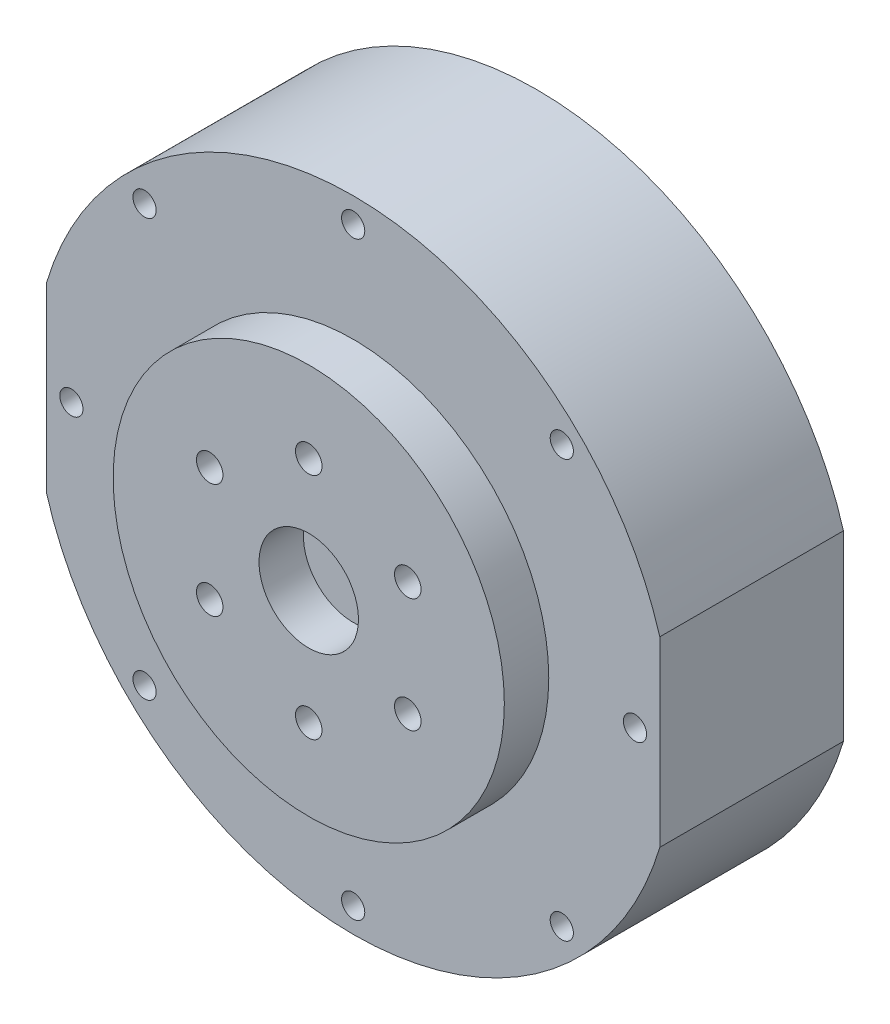
ISO-10303-21;
HEADER;
FILE_DESCRIPTION(('STEP AP214'),'2;1');
FILE_NAME('part.step','',(''),(''),'','','');
FILE_SCHEMA(('AUTOMOTIVE_DESIGN { 1 0 10303 214 1 1 1 1 }'));
ENDSEC;
DATA;
#1=APPLICATION_CONTEXT('core data for automotive mechanical design processes');
#2=APPLICATION_PROTOCOL_DEFINITION('international standard','automotive_design',2000,#1);
#3=PRODUCT_CONTEXT('',#1,'mechanical');
#4=PRODUCT('Part','Part','',(#3));
#5=PRODUCT_RELATED_PRODUCT_CATEGORY('part','',(#4));
#6=PRODUCT_DEFINITION_FORMATION('','',#4);
#7=PRODUCT_DEFINITION_CONTEXT('part definition',#1,'design');
#8=PRODUCT_DEFINITION('design','',#6,#7);
#9=PRODUCT_DEFINITION_SHAPE('','',#8);
#10=(LENGTH_UNIT() NAMED_UNIT(*) SI_UNIT(.MILLI.,.METRE.));
#11=(NAMED_UNIT(*) PLANE_ANGLE_UNIT() SI_UNIT($,.RADIAN.));
#12=(NAMED_UNIT(*) SI_UNIT($,.STERADIAN.) SOLID_ANGLE_UNIT());
#13=UNCERTAINTY_MEASURE_WITH_UNIT(LENGTH_MEASURE(1.E-05),#10,'distance_accuracy_value','');
#14=(GEOMETRIC_REPRESENTATION_CONTEXT(3) GLOBAL_UNCERTAINTY_ASSIGNED_CONTEXT((#13)) GLOBAL_UNIT_ASSIGNED_CONTEXT((#10,
#11,#12)) REPRESENTATION_CONTEXT('',''));
#15=CARTESIAN_POINT('',(0.,0.,0.));
#16=DIRECTION('',(0.,0.,1.));
#17=DIRECTION('',(1.,0.,0.));
#18=AXIS2_PLACEMENT_3D('',#15,#16,#17);
#19=CARTESIAN_POINT('',(0.,0.,27.7));
#20=DIRECTION('',(0.,0.,-1.));
#21=DIRECTION('',(-1.,0.,0.));
#22=AXIS2_PLACEMENT_3D('',#19,#20,#21);
#23=CYLINDRICAL_SURFACE('',#22,48.25);
#24=CARTESIAN_POINT('',(0.,0.,27.7));
#25=DIRECTION('',(0.,0.,1.));
#26=DIRECTION('',(1.,0.,0.));
#27=AXIS2_PLACEMENT_3D('',#24,#25,#26);
#28=CIRCLE('',#27,48.25);
#29=CARTESIAN_POINT('',(-46.25,-13.7477270848675,27.7));
#30=VERTEX_POINT('',#29);
#31=CARTESIAN_POINT('',(46.25,-13.7477270848675,27.7));
#32=VERTEX_POINT('',#31);
#33=EDGE_CURVE('E94',#30,#32,#28,.T.);
#34=ORIENTED_EDGE('',*,*,#33,.F.);
#35=DIRECTION('',(0.,0.,1.));
#36=VECTOR('',#35,1.);
#37=CARTESIAN_POINT('',(-46.25,-13.7477270848675,-8.));
#38=LINE('',#37,#36);
#39=CARTESIAN_POINT('',(-46.25,-13.7477270848675,0.));
#40=VERTEX_POINT('',#39);
#41=EDGE_CURVE('E79',#40,#30,#38,.T.);
#42=ORIENTED_EDGE('',*,*,#41,.F.);
#43=CARTESIAN_POINT('',(0.,0.,0.));
#44=DIRECTION('',(0.,0.,1.));
#45=DIRECTION('',(1.,0.,0.));
#46=AXIS2_PLACEMENT_3D('',#43,#44,#45);
#47=CIRCLE('',#46,48.25);
#48=CARTESIAN_POINT('',(46.25,-13.7477270848675,0.));
#49=VERTEX_POINT('',#48);
#50=EDGE_CURVE('E103',#40,#49,#47,.T.);
#51=ORIENTED_EDGE('',*,*,#50,.T.);
#52=DIRECTION('',(0.,0.,1.));
#53=VECTOR('',#52,1.);
#54=CARTESIAN_POINT('',(46.25,-13.7477270848675,-8.));
#55=LINE('',#54,#53);
#56=EDGE_CURVE('E56',#49,#32,#55,.T.);
#57=ORIENTED_EDGE('',*,*,#56,.T.);
#58=EDGE_LOOP('',(#34,#42,#51,#57));
#59=FACE_BOUND('',#58,.T.);
#60=ADVANCED_FACE('F41',(#59),#23,.T.);
#61=CARTESIAN_POINT('',(46.25,13.7477270848675,0.));
#62=VERTEX_POINT('',#61);
#63=CARTESIAN_POINT('',(-46.25,13.7477270848675,0.));
#64=VERTEX_POINT('',#63);
#65=EDGE_CURVE('E99',#62,#64,#47,.T.);
#66=ORIENTED_EDGE('',*,*,#65,.T.);
#67=DIRECTION('',(0.,0.,1.));
#68=VECTOR('',#67,1.);
#69=CARTESIAN_POINT('',(-46.25,13.7477270848675,-8.));
#70=LINE('',#69,#68);
#71=CARTESIAN_POINT('',(-46.25,13.7477270848675,27.7));
#72=VERTEX_POINT('',#71);
#73=EDGE_CURVE('E64',#64,#72,#70,.T.);
#74=ORIENTED_EDGE('',*,*,#73,.T.);
#75=CARTESIAN_POINT('',(46.25,13.7477270848675,27.7));
#76=VERTEX_POINT('',#75);
#77=EDGE_CURVE('E96',#76,#72,#28,.T.);
#78=ORIENTED_EDGE('',*,*,#77,.F.);
#79=DIRECTION('',(0.,0.,1.));
#80=VECTOR('',#79,1.);
#81=CARTESIAN_POINT('',(46.25,13.7477270848675,-8.));
#82=LINE('',#81,#80);
#83=EDGE_CURVE('E261',#62,#76,#82,.T.);
#84=ORIENTED_EDGE('',*,*,#83,.F.);
#85=EDGE_LOOP('',(#66,#74,#78,#84));
#86=FACE_BOUND('',#85,.T.);
#87=ADVANCED_FACE('F43',(#86),#23,.T.);
#88=CARTESIAN_POINT('',(0.,0.,27.7));
#89=DIRECTION('',(0.,0.,1.));
#90=DIRECTION('',(1.,0.,0.));
#91=AXIS2_PLACEMENT_3D('',#88,#89,#90);
#92=PLANE('',#91);
#93=DIRECTION('',(0.,1.,0.));
#94=VECTOR('',#93,1.);
#95=CARTESIAN_POINT('',(-46.25,13.7477270848675,27.7));
#96=LINE('',#95,#94);
#97=EDGE_CURVE('E82',#30,#72,#96,.T.);
#98=ORIENTED_EDGE('',*,*,#97,.F.);
#99=ORIENTED_EDGE('',*,*,#33,.T.);
#100=DIRECTION('',(0.,-1.,0.));
#101=VECTOR('',#100,1.);
#102=CARTESIAN_POINT('',(46.25,-13.7477270848675,27.7));
#103=LINE('',#102,#101);
#104=EDGE_CURVE('E97',#76,#32,#103,.T.);
#105=ORIENTED_EDGE('',*,*,#104,.F.);
#106=ORIENTED_EDGE('',*,*,#77,.T.);
#107=EDGE_LOOP('',(#98,#99,#105,#106));
#108=FACE_BOUND('',#107,.T.);
#109=CARTESIAN_POINT('',(0.,44.5,27.7));
#110=DIRECTION('',(0.,0.,1.));
#111=DIRECTION('',(1.,0.,0.));
#112=AXIS2_PLACEMENT_3D('',#109,#110,#111);
#113=CIRCLE('',#112,1.75);
#114=CARTESIAN_POINT('',(1.75,44.5,27.7));
#115=VERTEX_POINT('',#114);
#116=EDGE_CURVE('E190',#115,#115,#113,.T.);
#117=ORIENTED_EDGE('',*,*,#116,.F.);
#118=EDGE_LOOP('',(#117));
#119=FACE_BOUND('',#118,.T.);
#120=CARTESIAN_POINT('',(42.5,0.,27.7));
#121=DIRECTION('',(0.,0.,1.));
#122=DIRECTION('',(1.,0.,0.));
#123=AXIS2_PLACEMENT_3D('',#120,#121,#122);
#124=CIRCLE('',#123,1.75);
#125=CARTESIAN_POINT('',(44.25,0.,27.7));
#126=VERTEX_POINT('',#125);
#127=EDGE_CURVE('E194',#126,#126,#124,.T.);
#128=ORIENTED_EDGE('',*,*,#127,.F.);
#129=EDGE_LOOP('',(#128));
#130=FACE_BOUND('',#129,.T.);
#131=CARTESIAN_POINT('',(-31.4662517628014,31.4662517628014,27.7));
#132=DIRECTION('',(0.,0.,1.));
#133=DIRECTION('',(1.,0.,0.));
#134=AXIS2_PLACEMENT_3D('',#131,#132,#133);
#135=CIRCLE('',#134,1.75);
#136=CARTESIAN_POINT('',(-29.7162517628014,31.4662517628014,27.7));
#137=VERTEX_POINT('',#136);
#138=EDGE_CURVE('E201',#137,#137,#135,.T.);
#139=ORIENTED_EDGE('',*,*,#138,.F.);
#140=EDGE_LOOP('',(#139));
#141=FACE_BOUND('',#140,.T.);
#142=CARTESIAN_POINT('',(-31.4662517628014,-31.4662517628014,27.7));
#143=DIRECTION('',(0.,0.,1.));
#144=DIRECTION('',(1.,0.,0.));
#145=AXIS2_PLACEMENT_3D('',#142,#143,#144);
#146=CIRCLE('',#145,1.75);
#147=CARTESIAN_POINT('',(-29.7162517628014,-31.4662517628014,27.7));
#148=VERTEX_POINT('',#147);
#149=EDGE_CURVE('E169',#148,#148,#146,.T.);
#150=ORIENTED_EDGE('',*,*,#149,.F.);
#151=EDGE_LOOP('',(#150));
#152=FACE_BOUND('',#151,.T.);
#153=CARTESIAN_POINT('',(0.,-44.5,27.7));
#154=DIRECTION('',(0.,0.,1.));
#155=DIRECTION('',(1.,0.,0.));
#156=AXIS2_PLACEMENT_3D('',#153,#154,#155);
#157=CIRCLE('',#156,1.75);
#158=CARTESIAN_POINT('',(1.75000000000001,-44.5,27.7));
#159=VERTEX_POINT('',#158);
#160=EDGE_CURVE('E168',#159,#159,#157,.T.);
#161=ORIENTED_EDGE('',*,*,#160,.F.);
#162=EDGE_LOOP('',(#161));
#163=FACE_BOUND('',#162,.T.);
#164=CARTESIAN_POINT('',(31.4662517628014,-31.4662517628014,27.7));
#165=DIRECTION('',(0.,0.,1.));
#166=DIRECTION('',(1.,0.,0.));
#167=AXIS2_PLACEMENT_3D('',#164,#165,#166);
#168=CIRCLE('',#167,1.75);
#169=CARTESIAN_POINT('',(33.2162517628014,-31.4662517628014,27.7));
#170=VERTEX_POINT('',#169);
#171=EDGE_CURVE('E175',#170,#170,#168,.T.);
#172=ORIENTED_EDGE('',*,*,#171,.F.);
#173=EDGE_LOOP('',(#172));
#174=FACE_BOUND('',#173,.T.);
#175=CARTESIAN_POINT('',(31.4662517628014,31.4662517628014,27.7));
#176=DIRECTION('',(0.,0.,1.));
#177=DIRECTION('',(1.,0.,0.));
#178=AXIS2_PLACEMENT_3D('',#175,#176,#177);
#179=CIRCLE('',#178,1.75);
#180=CARTESIAN_POINT('',(33.2162517628014,31.4662517628014,27.7));
#181=VERTEX_POINT('',#180);
#182=EDGE_CURVE('E181',#181,#181,#179,.T.);
#183=ORIENTED_EDGE('',*,*,#182,.F.);
#184=EDGE_LOOP('',(#183));
#185=FACE_BOUND('',#184,.T.);
#186=CARTESIAN_POINT('',(-42.5,0.,27.7));
#187=DIRECTION('',(0.,0.,1.));
#188=DIRECTION('',(1.,0.,0.));
#189=AXIS2_PLACEMENT_3D('',#186,#187,#188);
#190=CIRCLE('',#189,1.75);
#191=CARTESIAN_POINT('',(-40.75,0.,27.7));
#192=VERTEX_POINT('',#191);
#193=EDGE_CURVE('E187',#192,#192,#190,.T.);
#194=ORIENTED_EDGE('',*,*,#193,.F.);
#195=EDGE_LOOP('',(#194));
#196=FACE_BOUND('',#195,.T.);
#197=CARTESIAN_POINT('',(0.,0.,27.7));
#198=DIRECTION('',(0.,0.,1.));
#199=DIRECTION('',(1.,0.,0.));
#200=AXIS2_PLACEMENT_3D('',#197,#198,#199);
#201=CIRCLE('',#200,29.5);
#202=CARTESIAN_POINT('',(29.5,0.,27.7));
#203=VERTEX_POINT('',#202);
#204=EDGE_CURVE('E138',#203,#203,#201,.T.);
#205=ORIENTED_EDGE('',*,*,#204,.F.);
#206=EDGE_LOOP('',(#205));
#207=FACE_BOUND('',#206,.T.);
#208=ADVANCED_FACE('F91',(#108,#119,#130,#141,#152,#163,#174,#185,#196,#207),#92,.T.);
#209=CARTESIAN_POINT('',(0.,0.,0.));
#210=DIRECTION('',(0.,0.,1.));
#211=DIRECTION('',(1.,0.,0.));
#212=AXIS2_PLACEMENT_3D('',#209,#210,#211);
#213=PLANE('',#212);
#214=CARTESIAN_POINT('',(0.,42.5,0.));
#215=DIRECTION('',(0.,0.,-1.));
#216=DIRECTION('',(-1.,0.,0.));
#217=AXIS2_PLACEMENT_3D('',#214,#215,#216);
#218=CIRCLE('',#217,1.75);
#219=CARTESIAN_POINT('',(-1.75,42.5,0.));
#220=VERTEX_POINT('',#219);
#221=EDGE_CURVE('E255',#220,#220,#218,.T.);
#222=ORIENTED_EDGE('',*,*,#221,.F.);
#223=EDGE_LOOP('',(#222));
#224=FACE_BOUND('',#223,.T.);
#225=CARTESIAN_POINT('',(-30.0520382004283,30.0520382004283,0.));
#226=DIRECTION('',(0.,0.,-1.));
#227=DIRECTION('',(-1.,0.,0.));
#228=AXIS2_PLACEMENT_3D('',#225,#226,#227);
#229=CIRCLE('',#228,1.75);
#230=CARTESIAN_POINT('',(-31.8020382004283,30.0520382004283,0.));
#231=VERTEX_POINT('',#230);
#232=EDGE_CURVE('E252',#231,#231,#229,.T.);
#233=ORIENTED_EDGE('',*,*,#232,.F.);
#234=EDGE_LOOP('',(#233));
#235=FACE_BOUND('',#234,.T.);
#236=CARTESIAN_POINT('',(-42.5,0.,0.));
#237=DIRECTION('',(0.,0.,-1.));
#238=DIRECTION('',(-1.,0.,0.));
#239=AXIS2_PLACEMENT_3D('',#236,#237,#238);
#240=CIRCLE('',#239,1.75);
#241=CARTESIAN_POINT('',(-44.25,0.,0.));
#242=VERTEX_POINT('',#241);
#243=EDGE_CURVE('E246',#242,#242,#240,.T.);
#244=ORIENTED_EDGE('',*,*,#243,.F.);
#245=EDGE_LOOP('',(#244));
#246=FACE_BOUND('',#245,.T.);
#247=CARTESIAN_POINT('',(-30.0520382004283,-30.0520382004283,0.));
#248=DIRECTION('',(0.,0.,-1.));
#249=DIRECTION('',(-1.,0.,0.));
#250=AXIS2_PLACEMENT_3D('',#247,#248,#249);
#251=CIRCLE('',#250,1.75);
#252=CARTESIAN_POINT('',(-31.8020382004283,-30.0520382004283,0.));
#253=VERTEX_POINT('',#252);
#254=EDGE_CURVE('E240',#253,#253,#251,.T.);
#255=ORIENTED_EDGE('',*,*,#254,.F.);
#256=EDGE_LOOP('',(#255));
#257=FACE_BOUND('',#256,.T.);
#258=CARTESIAN_POINT('',(0.,-42.5,0.));
#259=DIRECTION('',(0.,0.,-1.));
#260=DIRECTION('',(-1.,0.,0.));
#261=AXIS2_PLACEMENT_3D('',#258,#259,#260);
#262=CIRCLE('',#261,1.75);
#263=CARTESIAN_POINT('',(-1.75000000000001,-42.5,0.));
#264=VERTEX_POINT('',#263);
#265=EDGE_CURVE('E234',#264,#264,#262,.T.);
#266=ORIENTED_EDGE('',*,*,#265,.F.);
#267=EDGE_LOOP('',(#266));
#268=FACE_BOUND('',#267,.T.);
#269=CARTESIAN_POINT('',(30.0520382004283,-30.0520382004283,0.));
#270=DIRECTION('',(0.,0.,-1.));
#271=DIRECTION('',(-1.,0.,0.));
#272=AXIS2_PLACEMENT_3D('',#269,#270,#271);
#273=CIRCLE('',#272,1.74999999999999);
#274=CARTESIAN_POINT('',(28.3020382004283,-30.0520382004283,0.));
#275=VERTEX_POINT('',#274);
#276=EDGE_CURVE('E228',#275,#275,#273,.T.);
#277=ORIENTED_EDGE('',*,*,#276,.F.);
#278=EDGE_LOOP('',(#277));
#279=FACE_BOUND('',#278,.T.);
#280=CARTESIAN_POINT('',(42.5,0.,0.));
#281=DIRECTION('',(0.,0.,-1.));
#282=DIRECTION('',(-1.,0.,0.));
#283=AXIS2_PLACEMENT_3D('',#280,#281,#282);
#284=CIRCLE('',#283,1.75);
#285=CARTESIAN_POINT('',(40.75,0.,0.));
#286=VERTEX_POINT('',#285);
#287=EDGE_CURVE('E222',#286,#286,#284,.T.);
#288=ORIENTED_EDGE('',*,*,#287,.F.);
#289=EDGE_LOOP('',(#288));
#290=FACE_BOUND('',#289,.T.);
#291=CARTESIAN_POINT('',(30.0520382004283,30.0520382004283,0.));
#292=DIRECTION('',(0.,0.,-1.));
#293=DIRECTION('',(-1.,0.,0.));
#294=AXIS2_PLACEMENT_3D('',#291,#292,#293);
#295=CIRCLE('',#294,1.75);
#296=CARTESIAN_POINT('',(28.3020382004283,30.0520382004283,0.));
#297=VERTEX_POINT('',#296);
#298=EDGE_CURVE('E216',#297,#297,#295,.T.);
#299=ORIENTED_EDGE('',*,*,#298,.F.);
#300=EDGE_LOOP('',(#299));
#301=FACE_BOUND('',#300,.T.);
#302=CARTESIAN_POINT('',(0.,0.,0.));
#303=DIRECTION('',(0.,0.,-1.));
#304=DIRECTION('',(-1.,0.,0.));
#305=AXIS2_PLACEMENT_3D('',#302,#303,#304);
#306=CIRCLE('',#305,29.);
#307=CARTESIAN_POINT('',(-29.,0.,0.));
#308=VERTEX_POINT('',#307);
#309=EDGE_CURVE('E101',#308,#308,#306,.T.);
#310=ORIENTED_EDGE('',*,*,#309,.F.);
#311=EDGE_LOOP('',(#310));
#312=FACE_BOUND('',#311,.T.);
#313=ORIENTED_EDGE('',*,*,#50,.F.);
#314=DIRECTION('',(0.,1.,0.));
#315=VECTOR('',#314,1.);
#316=CARTESIAN_POINT('',(-46.25,0.,0.));
#317=LINE('',#316,#315);
#318=EDGE_CURVE('E11',#40,#64,#317,.T.);
#319=ORIENTED_EDGE('',*,*,#318,.T.);
#320=ORIENTED_EDGE('',*,*,#65,.F.);
#321=DIRECTION('',(0.,-1.,0.));
#322=VECTOR('',#321,1.);
#323=CARTESIAN_POINT('',(46.25,0.,0.));
#324=LINE('',#323,#322);
#325=EDGE_CURVE('E49',#62,#49,#324,.T.);
#326=ORIENTED_EDGE('',*,*,#325,.T.);
#327=EDGE_LOOP('',(#313,#319,#320,#326));
#328=FACE_BOUND('',#327,.T.);
#329=ADVANCED_FACE('F130',(#224,#235,#246,#257,#268,#279,#290,#301,#312,#328),#213,.F.);
#330=CARTESIAN_POINT('',(0.,0.,-8.));
#331=DIRECTION('',(0.,0.,1.));
#332=DIRECTION('',(1.,0.,0.));
#333=AXIS2_PLACEMENT_3D('',#330,#331,#332);
#334=CYLINDRICAL_SURFACE('',#333,29.);
#335=CARTESIAN_POINT('',(0.,0.,-8.));
#336=DIRECTION('',(0.,0.,-1.));
#337=DIRECTION('',(-1.,0.,0.));
#338=AXIS2_PLACEMENT_3D('',#335,#336,#337);
#339=CIRCLE('',#338,29.);
#340=CARTESIAN_POINT('',(-29.,0.,-8.));
#341=VERTEX_POINT('',#340);
#342=EDGE_CURVE('E132',#341,#341,#339,.T.);
#343=ORIENTED_EDGE('',*,*,#342,.F.);
#344=EDGE_LOOP('',(#343));
#345=FACE_BOUND('',#344,.T.);
#346=ORIENTED_EDGE('',*,*,#309,.T.);
#347=EDGE_LOOP('',(#346));
#348=FACE_BOUND('',#347,.T.);
#349=ADVANCED_FACE('F290',(#345,#348),#334,.T.);
#350=CARTESIAN_POINT('',(0.,0.,-8.));
#351=DIRECTION('',(0.,0.,-1.));
#352=DIRECTION('',(-1.,0.,0.));
#353=AXIS2_PLACEMENT_3D('',#350,#351,#352);
#354=PLANE('',#353);
#355=ORIENTED_EDGE('',*,*,#342,.T.);
#356=EDGE_LOOP('',(#355));
#357=FACE_BOUND('',#356,.T.);
#358=ADVANCED_FACE('F345',(#357),#354,.T.);
#359=CARTESIAN_POINT('',(0.,0.,34.4));
#360=DIRECTION('',(0.,0.,1.));
#361=DIRECTION('',(1.,0.,0.));
#362=AXIS2_PLACEMENT_3D('',#359,#360,#361);
#363=PLANE('',#362);
#364=CARTESIAN_POINT('',(-14.9389382152816,-8.62500000000001,34.4));
#365=DIRECTION('',(0.,0.,1.));
#366=DIRECTION('',(1.,0.,0.));
#367=AXIS2_PLACEMENT_3D('',#364,#365,#366);
#368=CIRCLE('',#367,2.);
#369=CARTESIAN_POINT('',(-12.9389382152816,-8.62500000000001,34.4));
#370=VERTEX_POINT('',#369);
#371=EDGE_CURVE('E158',#370,#370,#368,.T.);
#372=ORIENTED_EDGE('',*,*,#371,.F.);
#373=EDGE_LOOP('',(#372));
#374=FACE_BOUND('',#373,.T.);
#375=CARTESIAN_POINT('',(14.9389382152816,-8.625,34.4));
#376=DIRECTION('',(0.,0.,1.));
#377=DIRECTION('',(1.,0.,0.));
#378=AXIS2_PLACEMENT_3D('',#375,#376,#377);
#379=CIRCLE('',#378,2.00000000000001);
#380=CARTESIAN_POINT('',(16.9389382152816,-8.625,34.4));
#381=VERTEX_POINT('',#380);
#382=EDGE_CURVE('E152',#381,#381,#379,.T.);
#383=ORIENTED_EDGE('',*,*,#382,.F.);
#384=EDGE_LOOP('',(#383));
#385=FACE_BOUND('',#384,.T.);
#386=CARTESIAN_POINT('',(0.,0.,34.4));
#387=DIRECTION('',(0.,0.,1.));
#388=DIRECTION('',(1.,0.,0.));
#389=AXIS2_PLACEMENT_3D('',#386,#387,#388);
#390=CIRCLE('',#389,7.5);
#391=CARTESIAN_POINT('',(7.5,0.,34.4));
#392=VERTEX_POINT('',#391);
#393=EDGE_CURVE('E146',#392,#392,#390,.T.);
#394=ORIENTED_EDGE('',*,*,#393,.F.);
#395=EDGE_LOOP('',(#394));
#396=FACE_BOUND('',#395,.T.);
#397=CARTESIAN_POINT('',(0.,0.,34.4));
#398=DIRECTION('',(0.,0.,1.));
#399=DIRECTION('',(1.,0.,0.));
#400=AXIS2_PLACEMENT_3D('',#397,#398,#399);
#401=CIRCLE('',#400,29.5);
#402=CARTESIAN_POINT('',(29.5,0.,34.4));
#403=VERTEX_POINT('',#402);
#404=EDGE_CURVE('E134',#403,#403,#401,.T.);
#405=ORIENTED_EDGE('',*,*,#404,.T.);
#406=EDGE_LOOP('',(#405));
#407=FACE_BOUND('',#406,.T.);
#408=CARTESIAN_POINT('',(0.,17.25,34.4));
#409=DIRECTION('',(0.,0.,1.));
#410=DIRECTION('',(1.,0.,0.));
#411=AXIS2_PLACEMENT_3D('',#408,#409,#410);
#412=CIRCLE('',#411,2.);
#413=CARTESIAN_POINT('',(2.,17.25,34.4));
#414=VERTEX_POINT('',#413);
#415=EDGE_CURVE('E142',#414,#414,#412,.T.);
#416=ORIENTED_EDGE('',*,*,#415,.F.);
#417=EDGE_LOOP('',(#416));
#418=FACE_BOUND('',#417,.T.);
#419=CARTESIAN_POINT('',(14.9389382152816,8.62500000000001,34.4));
#420=DIRECTION('',(0.,0.,1.));
#421=DIRECTION('',(1.,0.,0.));
#422=AXIS2_PLACEMENT_3D('',#419,#420,#421);
#423=CIRCLE('',#422,2.);
#424=CARTESIAN_POINT('',(16.9389382152816,8.62500000000001,34.4));
#425=VERTEX_POINT('',#424);
#426=EDGE_CURVE('E149',#425,#425,#423,.T.);
#427=ORIENTED_EDGE('',*,*,#426,.F.);
#428=EDGE_LOOP('',(#427));
#429=FACE_BOUND('',#428,.T.);
#430=CARTESIAN_POINT('',(0.,-17.25,34.4));
#431=DIRECTION('',(0.,0.,1.));
#432=DIRECTION('',(1.,0.,0.));
#433=AXIS2_PLACEMENT_3D('',#430,#431,#432);
#434=CIRCLE('',#433,2.);
#435=CARTESIAN_POINT('',(2.,-17.25,34.4));
#436=VERTEX_POINT('',#435);
#437=EDGE_CURVE('E155',#436,#436,#434,.T.);
#438=ORIENTED_EDGE('',*,*,#437,.F.);
#439=EDGE_LOOP('',(#438));
#440=FACE_BOUND('',#439,.T.);
#441=CARTESIAN_POINT('',(-14.9389382152816,8.62499999999999,34.4));
#442=DIRECTION('',(0.,0.,1.));
#443=DIRECTION('',(1.,0.,0.));
#444=AXIS2_PLACEMENT_3D('',#441,#442,#443);
#445=CIRCLE('',#444,2.);
#446=CARTESIAN_POINT('',(-12.9389382152816,8.62499999999999,34.4));
#447=VERTEX_POINT('',#446);
#448=EDGE_CURVE('E161',#447,#447,#445,.T.);
#449=ORIENTED_EDGE('',*,*,#448,.F.);
#450=EDGE_LOOP('',(#449));
#451=FACE_BOUND('',#450,.T.);
#452=ADVANCED_FACE('F342',(#374,#385,#396,#407,#418,#429,#440,#451),#363,.T.);
#453=CARTESIAN_POINT('',(0.,0.,34.4));
#454=DIRECTION('',(0.,0.,-1.));
#455=DIRECTION('',(-1.,0.,0.));
#456=AXIS2_PLACEMENT_3D('',#453,#454,#455);
#457=CYLINDRICAL_SURFACE('',#456,29.5);
#458=ORIENTED_EDGE('',*,*,#404,.F.);
#459=EDGE_LOOP('',(#458));
#460=FACE_BOUND('',#459,.T.);
#461=ORIENTED_EDGE('',*,*,#204,.T.);
#462=EDGE_LOOP('',(#461));
#463=FACE_BOUND('',#462,.T.);
#464=ADVANCED_FACE('F340',(#460,#463),#457,.T.);
#465=CARTESIAN_POINT('',(0.,17.25,34.4));
#466=DIRECTION('',(0.,0.,-1.));
#467=DIRECTION('',(-1.,0.,0.));
#468=AXIS2_PLACEMENT_3D('',#465,#466,#467);
#469=CYLINDRICAL_SURFACE('',#468,2.);
#470=ORIENTED_EDGE('',*,*,#415,.T.);
#471=EDGE_LOOP('',(#470));
#472=FACE_BOUND('',#471,.T.);
#473=CARTESIAN_POINT('',(0.,17.25,27.7));
#474=DIRECTION('',(0.,0.,1.));
#475=DIRECTION('',(1.,0.,0.));
#476=AXIS2_PLACEMENT_3D('',#473,#474,#475);
#477=CIRCLE('',#476,2.);
#478=CARTESIAN_POINT('',(2.,17.25,27.7));
#479=VERTEX_POINT('',#478);
#480=EDGE_CURVE('E126',#479,#479,#477,.F.);
#481=ORIENTED_EDGE('',*,*,#480,.T.);
#482=EDGE_LOOP('',(#481));
#483=FACE_BOUND('',#482,.T.);
#484=ADVANCED_FACE('F336',(#472,#483),#469,.F.);
#485=CARTESIAN_POINT('',(0.,0.,34.4));
#486=DIRECTION('',(0.,0.,-1.));
#487=DIRECTION('',(-1.,0.,0.));
#488=AXIS2_PLACEMENT_3D('',#485,#486,#487);
#489=CYLINDRICAL_SURFACE('',#488,7.5);
#490=ORIENTED_EDGE('',*,*,#393,.T.);
#491=EDGE_LOOP('',(#490));
#492=FACE_BOUND('',#491,.T.);
#493=CARTESIAN_POINT('',(0.,0.,27.7));
#494=DIRECTION('',(0.,0.,1.));
#495=DIRECTION('',(1.,0.,0.));
#496=AXIS2_PLACEMENT_3D('',#493,#494,#495);
#497=CIRCLE('',#496,7.5);
#498=CARTESIAN_POINT('',(7.5,0.,27.7));
#499=VERTEX_POINT('',#498);
#500=EDGE_CURVE('E123',#499,#499,#497,.F.);
#501=ORIENTED_EDGE('',*,*,#500,.T.);
#502=EDGE_LOOP('',(#501));
#503=FACE_BOUND('',#502,.T.);
#504=ADVANCED_FACE('F332',(#492,#503),#489,.F.);
#505=CARTESIAN_POINT('',(14.9389382152816,8.62500000000001,34.4));
#506=DIRECTION('',(0.,0.,-1.));
#507=DIRECTION('',(-1.,0.,0.));
#508=AXIS2_PLACEMENT_3D('',#505,#506,#507);
#509=CYLINDRICAL_SURFACE('',#508,2.);
#510=ORIENTED_EDGE('',*,*,#426,.T.);
#511=EDGE_LOOP('',(#510));
#512=FACE_BOUND('',#511,.T.);
#513=CARTESIAN_POINT('',(14.9389382152816,8.62500000000001,27.7));
#514=DIRECTION('',(0.,0.,1.));
#515=DIRECTION('',(1.,0.,0.));
#516=AXIS2_PLACEMENT_3D('',#513,#514,#515);
#517=CIRCLE('',#516,2.);
#518=CARTESIAN_POINT('',(16.9389382152816,8.62500000000001,27.7));
#519=VERTEX_POINT('',#518);
#520=EDGE_CURVE('E120',#519,#519,#517,.F.);
#521=ORIENTED_EDGE('',*,*,#520,.T.);
#522=EDGE_LOOP('',(#521));
#523=FACE_BOUND('',#522,.T.);
#524=ADVANCED_FACE('F328',(#512,#523),#509,.F.);
#525=CARTESIAN_POINT('',(14.9389382152816,-8.625,34.4));
#526=DIRECTION('',(0.,0.,-1.));
#527=DIRECTION('',(-1.,0.,0.));
#528=AXIS2_PLACEMENT_3D('',#525,#526,#527);
#529=CYLINDRICAL_SURFACE('',#528,2.00000000000001);
#530=ORIENTED_EDGE('',*,*,#382,.T.);
#531=EDGE_LOOP('',(#530));
#532=FACE_BOUND('',#531,.T.);
#533=CARTESIAN_POINT('',(14.9389382152816,-8.625,27.7));
#534=DIRECTION('',(0.,0.,1.));
#535=DIRECTION('',(1.,0.,0.));
#536=AXIS2_PLACEMENT_3D('',#533,#534,#535);
#537=CIRCLE('',#536,2.00000000000001);
#538=CARTESIAN_POINT('',(16.9389382152816,-8.625,27.7));
#539=VERTEX_POINT('',#538);
#540=EDGE_CURVE('E117',#539,#539,#537,.F.);
#541=ORIENTED_EDGE('',*,*,#540,.T.);
#542=EDGE_LOOP('',(#541));
#543=FACE_BOUND('',#542,.T.);
#544=ADVANCED_FACE('F324',(#532,#543),#529,.F.);
#545=CARTESIAN_POINT('',(0.,-17.25,34.4));
#546=DIRECTION('',(0.,0.,-1.));
#547=DIRECTION('',(-1.,0.,0.));
#548=AXIS2_PLACEMENT_3D('',#545,#546,#547);
#549=CYLINDRICAL_SURFACE('',#548,2.);
#550=ORIENTED_EDGE('',*,*,#437,.T.);
#551=EDGE_LOOP('',(#550));
#552=FACE_BOUND('',#551,.T.);
#553=CARTESIAN_POINT('',(0.,-17.25,27.7));
#554=DIRECTION('',(0.,0.,1.));
#555=DIRECTION('',(1.,0.,0.));
#556=AXIS2_PLACEMENT_3D('',#553,#554,#555);
#557=CIRCLE('',#556,2.);
#558=CARTESIAN_POINT('',(2.,-17.25,27.7));
#559=VERTEX_POINT('',#558);
#560=EDGE_CURVE('E114',#559,#559,#557,.F.);
#561=ORIENTED_EDGE('',*,*,#560,.T.);
#562=EDGE_LOOP('',(#561));
#563=FACE_BOUND('',#562,.T.);
#564=ADVANCED_FACE('F315',(#552,#563),#549,.F.);
#565=CARTESIAN_POINT('',(-14.9389382152816,-8.62500000000001,34.4));
#566=DIRECTION('',(0.,0.,-1.));
#567=DIRECTION('',(-1.,0.,0.));
#568=AXIS2_PLACEMENT_3D('',#565,#566,#567);
#569=CYLINDRICAL_SURFACE('',#568,2.);
#570=ORIENTED_EDGE('',*,*,#371,.T.);
#571=EDGE_LOOP('',(#570));
#572=FACE_BOUND('',#571,.T.);
#573=CARTESIAN_POINT('',(-14.9389382152816,-8.62500000000001,27.7));
#574=DIRECTION('',(0.,0.,1.));
#575=DIRECTION('',(1.,0.,0.));
#576=AXIS2_PLACEMENT_3D('',#573,#574,#575);
#577=CIRCLE('',#576,2.);
#578=CARTESIAN_POINT('',(-12.9389382152816,-8.62500000000001,27.7));
#579=VERTEX_POINT('',#578);
#580=EDGE_CURVE('E111',#579,#579,#577,.F.);
#581=ORIENTED_EDGE('',*,*,#580,.T.);
#582=EDGE_LOOP('',(#581));
#583=FACE_BOUND('',#582,.T.);
#584=ADVANCED_FACE('F307',(#572,#583),#569,.F.);
#585=CARTESIAN_POINT('',(-14.9389382152816,8.62499999999999,34.4));
#586=DIRECTION('',(0.,0.,-1.));
#587=DIRECTION('',(-1.,0.,0.));
#588=AXIS2_PLACEMENT_3D('',#585,#586,#587);
#589=CYLINDRICAL_SURFACE('',#588,2.);
#590=ORIENTED_EDGE('',*,*,#448,.T.);
#591=EDGE_LOOP('',(#590));
#592=FACE_BOUND('',#591,.T.);
#593=CARTESIAN_POINT('',(-14.9389382152816,8.62499999999999,27.7));
#594=DIRECTION('',(0.,0.,1.));
#595=DIRECTION('',(1.,0.,0.));
#596=AXIS2_PLACEMENT_3D('',#593,#594,#595);
#597=CIRCLE('',#596,2.);
#598=CARTESIAN_POINT('',(-12.9389382152816,8.62499999999999,27.7));
#599=VERTEX_POINT('',#598);
#600=EDGE_CURVE('E108',#599,#599,#597,.F.);
#601=ORIENTED_EDGE('',*,*,#600,.T.);
#602=EDGE_LOOP('',(#601));
#603=FACE_BOUND('',#602,.T.);
#604=ADVANCED_FACE('F299',(#592,#603),#589,.F.);
#605=ORIENTED_EDGE('',*,*,#600,.F.);
#606=EDGE_LOOP('',(#605));
#607=FACE_BOUND('',#606,.T.);
#608=ADVANCED_FACE('F286',(#607),#92,.T.);
#609=ORIENTED_EDGE('',*,*,#580,.F.);
#610=EDGE_LOOP('',(#609));
#611=FACE_BOUND('',#610,.T.);
#612=ADVANCED_FACE('F298',(#611),#92,.T.);
#613=ORIENTED_EDGE('',*,*,#560,.F.);
#614=EDGE_LOOP('',(#613));
#615=FACE_BOUND('',#614,.T.);
#616=ADVANCED_FACE('F305',(#615),#92,.T.);
#617=ORIENTED_EDGE('',*,*,#540,.F.);
#618=EDGE_LOOP('',(#617));
#619=FACE_BOUND('',#618,.T.);
#620=ADVANCED_FACE('F424',(#619),#92,.T.);
#621=ORIENTED_EDGE('',*,*,#520,.F.);
#622=EDGE_LOOP('',(#621));
#623=FACE_BOUND('',#622,.T.);
#624=ADVANCED_FACE('F433',(#623),#92,.T.);
#625=ORIENTED_EDGE('',*,*,#500,.F.);
#626=EDGE_LOOP('',(#625));
#627=FACE_BOUND('',#626,.T.);
#628=ADVANCED_FACE('F295',(#627),#92,.T.);
#629=ORIENTED_EDGE('',*,*,#480,.F.);
#630=EDGE_LOOP('',(#629));
#631=FACE_BOUND('',#630,.T.);
#632=ADVANCED_FACE('F285',(#631),#92,.T.);
#633=CARTESIAN_POINT('',(-42.5,0.,22.7));
#634=DIRECTION('',(0.,0.,1.));
#635=DIRECTION('',(1.,0.,0.));
#636=AXIS2_PLACEMENT_3D('',#633,#634,#635);
#637=CYLINDRICAL_SURFACE('',#636,1.75);
#638=CARTESIAN_POINT('',(-42.5,0.,22.7));
#639=DIRECTION('',(0.,0.,1.));
#640=DIRECTION('',(1.,0.,0.));
#641=AXIS2_PLACEMENT_3D('',#638,#639,#640);
#642=CIRCLE('',#641,1.75);
#643=CARTESIAN_POINT('',(-40.75,0.,22.7));
#644=VERTEX_POINT('',#643);
#645=EDGE_CURVE('E184',#644,#644,#642,.T.);
#646=ORIENTED_EDGE('',*,*,#645,.F.);
#647=EDGE_LOOP('',(#646));
#648=FACE_BOUND('',#647,.T.);
#649=ORIENTED_EDGE('',*,*,#193,.T.);
#650=EDGE_LOOP('',(#649));
#651=FACE_BOUND('',#650,.T.);
#652=ADVANCED_FACE('F294',(#648,#651),#637,.F.);
#653=CARTESIAN_POINT('',(-42.5,0.,22.7));
#654=DIRECTION('',(0.,0.,1.));
#655=DIRECTION('',(1.,0.,0.));
#656=AXIS2_PLACEMENT_3D('',#653,#654,#655);
#657=PLANE('',#656);
#658=ORIENTED_EDGE('',*,*,#645,.T.);
#659=EDGE_LOOP('',(#658));
#660=FACE_BOUND('',#659,.T.);
#661=ADVANCED_FACE('F464',(#660),#657,.T.);
#662=CARTESIAN_POINT('',(31.4662517628014,31.4662517628014,22.7));
#663=DIRECTION('',(0.,0.,1.));
#664=DIRECTION('',(1.,0.,0.));
#665=AXIS2_PLACEMENT_3D('',#662,#663,#664);
#666=CYLINDRICAL_SURFACE('',#665,1.75);
#667=CARTESIAN_POINT('',(31.4662517628014,31.4662517628014,22.7));
#668=DIRECTION('',(0.,0.,1.));
#669=DIRECTION('',(1.,0.,0.));
#670=AXIS2_PLACEMENT_3D('',#667,#668,#669);
#671=CIRCLE('',#670,1.75);
#672=CARTESIAN_POINT('',(33.2162517628014,31.4662517628014,22.7));
#673=VERTEX_POINT('',#672);
#674=EDGE_CURVE('E178',#673,#673,#671,.T.);
#675=ORIENTED_EDGE('',*,*,#674,.F.);
#676=EDGE_LOOP('',(#675));
#677=FACE_BOUND('',#676,.T.);
#678=ORIENTED_EDGE('',*,*,#182,.T.);
#679=EDGE_LOOP('',(#678));
#680=FACE_BOUND('',#679,.T.);
#681=ADVANCED_FACE('F475',(#677,#680),#666,.F.);
#682=CARTESIAN_POINT('',(31.4662517628014,31.4662517628014,22.7));
#683=DIRECTION('',(0.,0.,1.));
#684=DIRECTION('',(1.,0.,0.));
#685=AXIS2_PLACEMENT_3D('',#682,#683,#684);
#686=PLANE('',#685);
#687=ORIENTED_EDGE('',*,*,#674,.T.);
#688=EDGE_LOOP('',(#687));
#689=FACE_BOUND('',#688,.T.);
#690=ADVANCED_FACE('F486',(#689),#686,.T.);
#691=CARTESIAN_POINT('',(31.4662517628014,-31.4662517628014,22.7));
#692=DIRECTION('',(0.,0.,1.));
#693=DIRECTION('',(1.,0.,0.));
#694=AXIS2_PLACEMENT_3D('',#691,#692,#693);
#695=CYLINDRICAL_SURFACE('',#694,1.75);
#696=CARTESIAN_POINT('',(31.4662517628014,-31.4662517628014,22.7));
#697=DIRECTION('',(0.,0.,1.));
#698=DIRECTION('',(1.,0.,0.));
#699=AXIS2_PLACEMENT_3D('',#696,#697,#698);
#700=CIRCLE('',#699,1.75);
#701=CARTESIAN_POINT('',(33.2162517628014,-31.4662517628014,22.7));
#702=VERTEX_POINT('',#701);
#703=EDGE_CURVE('E172',#702,#702,#700,.T.);
#704=ORIENTED_EDGE('',*,*,#703,.F.);
#705=EDGE_LOOP('',(#704));
#706=FACE_BOUND('',#705,.T.);
#707=ORIENTED_EDGE('',*,*,#171,.T.);
#708=EDGE_LOOP('',(#707));
#709=FACE_BOUND('',#708,.T.);
#710=ADVANCED_FACE('F497',(#706,#709),#695,.F.);
#711=CARTESIAN_POINT('',(31.4662517628014,-31.4662517628014,22.7));
#712=DIRECTION('',(0.,0.,1.));
#713=DIRECTION('',(1.,0.,0.));
#714=AXIS2_PLACEMENT_3D('',#711,#712,#713);
#715=PLANE('',#714);
#716=ORIENTED_EDGE('',*,*,#703,.T.);
#717=EDGE_LOOP('',(#716));
#718=FACE_BOUND('',#717,.T.);
#719=ADVANCED_FACE('F508',(#718),#715,.T.);
#720=CARTESIAN_POINT('',(0.,-44.5,22.7));
#721=DIRECTION('',(0.,0.,1.));
#722=DIRECTION('',(1.,0.,0.));
#723=AXIS2_PLACEMENT_3D('',#720,#721,#722);
#724=CYLINDRICAL_SURFACE('',#723,1.75);
#725=CARTESIAN_POINT('',(0.,-44.5,22.7));
#726=DIRECTION('',(0.,0.,1.));
#727=DIRECTION('',(1.,0.,0.));
#728=AXIS2_PLACEMENT_3D('',#725,#726,#727);
#729=CIRCLE('',#728,1.75);
#730=CARTESIAN_POINT('',(1.75000000000001,-44.5,22.7));
#731=VERTEX_POINT('',#730);
#732=EDGE_CURVE('E165',#731,#731,#729,.T.);
#733=ORIENTED_EDGE('',*,*,#732,.F.);
#734=EDGE_LOOP('',(#733));
#735=FACE_BOUND('',#734,.T.);
#736=ORIENTED_EDGE('',*,*,#160,.T.);
#737=EDGE_LOOP('',(#736));
#738=FACE_BOUND('',#737,.T.);
#739=ADVANCED_FACE('F519',(#735,#738),#724,.F.);
#740=CARTESIAN_POINT('',(0.,-44.5,22.7));
#741=DIRECTION('',(0.,0.,1.));
#742=DIRECTION('',(1.,0.,0.));
#743=AXIS2_PLACEMENT_3D('',#740,#741,#742);
#744=PLANE('',#743);
#745=ORIENTED_EDGE('',*,*,#732,.T.);
#746=EDGE_LOOP('',(#745));
#747=FACE_BOUND('',#746,.T.);
#748=ADVANCED_FACE('F319',(#747),#744,.T.);
#749=CARTESIAN_POINT('',(-31.4662517628014,-31.4662517628014,22.7));
#750=DIRECTION('',(0.,0.,1.));
#751=DIRECTION('',(1.,0.,0.));
#752=AXIS2_PLACEMENT_3D('',#749,#750,#751);
#753=CYLINDRICAL_SURFACE('',#752,1.75);
#754=CARTESIAN_POINT('',(-31.4662517628014,-31.4662517628014,22.7));
#755=DIRECTION('',(0.,0.,1.));
#756=DIRECTION('',(1.,0.,0.));
#757=AXIS2_PLACEMENT_3D('',#754,#755,#756);
#758=CIRCLE('',#757,1.75);
#759=CARTESIAN_POINT('',(-29.7162517628014,-31.4662517628014,22.7));
#760=VERTEX_POINT('',#759);
#761=EDGE_CURVE('E204',#760,#760,#758,.T.);
#762=ORIENTED_EDGE('',*,*,#761,.F.);
#763=EDGE_LOOP('',(#762));
#764=FACE_BOUND('',#763,.T.);
#765=ORIENTED_EDGE('',*,*,#149,.T.);
#766=EDGE_LOOP('',(#765));
#767=FACE_BOUND('',#766,.T.);
#768=ADVANCED_FACE('F539',(#764,#767),#753,.F.);
#769=CARTESIAN_POINT('',(-31.4662517628014,-31.4662517628014,22.7));
#770=DIRECTION('',(0.,0.,1.));
#771=DIRECTION('',(1.,0.,0.));
#772=AXIS2_PLACEMENT_3D('',#769,#770,#771);
#773=PLANE('',#772);
#774=ORIENTED_EDGE('',*,*,#761,.T.);
#775=EDGE_LOOP('',(#774));
#776=FACE_BOUND('',#775,.T.);
#777=ADVANCED_FACE('F549',(#776),#773,.T.);
#778=CARTESIAN_POINT('',(-31.4662517628014,31.4662517628014,22.7));
#779=DIRECTION('',(0.,0.,1.));
#780=DIRECTION('',(1.,0.,0.));
#781=AXIS2_PLACEMENT_3D('',#778,#779,#780);
#782=CYLINDRICAL_SURFACE('',#781,1.75);
#783=CARTESIAN_POINT('',(-31.4662517628014,31.4662517628014,22.7));
#784=DIRECTION('',(0.,0.,1.));
#785=DIRECTION('',(1.,0.,0.));
#786=AXIS2_PLACEMENT_3D('',#783,#784,#785);
#787=CIRCLE('',#786,1.75);
#788=CARTESIAN_POINT('',(-29.7162517628014,31.4662517628014,22.7));
#789=VERTEX_POINT('',#788);
#790=EDGE_CURVE('E198',#789,#789,#787,.T.);
#791=ORIENTED_EDGE('',*,*,#790,.F.);
#792=EDGE_LOOP('',(#791));
#793=FACE_BOUND('',#792,.T.);
#794=ORIENTED_EDGE('',*,*,#138,.T.);
#795=EDGE_LOOP('',(#794));
#796=FACE_BOUND('',#795,.T.);
#797=ADVANCED_FACE('F560',(#793,#796),#782,.F.);
#798=CARTESIAN_POINT('',(-31.4662517628014,31.4662517628014,22.7));
#799=DIRECTION('',(0.,0.,1.));
#800=DIRECTION('',(1.,0.,0.));
#801=AXIS2_PLACEMENT_3D('',#798,#799,#800);
#802=PLANE('',#801);
#803=ORIENTED_EDGE('',*,*,#790,.T.);
#804=EDGE_LOOP('',(#803));
#805=FACE_BOUND('',#804,.T.);
#806=ADVANCED_FACE('F571',(#805),#802,.T.);
#807=CARTESIAN_POINT('',(42.5,0.,22.7));
#808=DIRECTION('',(0.,0.,1.));
#809=DIRECTION('',(1.,0.,0.));
#810=AXIS2_PLACEMENT_3D('',#807,#808,#809);
#811=CYLINDRICAL_SURFACE('',#810,1.75);
#812=CARTESIAN_POINT('',(42.5,0.,22.7));
#813=DIRECTION('',(0.,0.,1.));
#814=DIRECTION('',(1.,0.,0.));
#815=AXIS2_PLACEMENT_3D('',#812,#813,#814);
#816=CIRCLE('',#815,1.75);
#817=CARTESIAN_POINT('',(44.25,0.,22.7));
#818=VERTEX_POINT('',#817);
#819=EDGE_CURVE('E191',#818,#818,#816,.T.);
#820=ORIENTED_EDGE('',*,*,#819,.F.);
#821=EDGE_LOOP('',(#820));
#822=FACE_BOUND('',#821,.T.);
#823=ORIENTED_EDGE('',*,*,#127,.T.);
#824=EDGE_LOOP('',(#823));
#825=FACE_BOUND('',#824,.T.);
#826=ADVANCED_FACE('F582',(#822,#825),#811,.F.);
#827=CARTESIAN_POINT('',(42.5,0.,22.7));
#828=DIRECTION('',(0.,0.,1.));
#829=DIRECTION('',(1.,0.,0.));
#830=AXIS2_PLACEMENT_3D('',#827,#828,#829);
#831=PLANE('',#830);
#832=ORIENTED_EDGE('',*,*,#819,.T.);
#833=EDGE_LOOP('',(#832));
#834=FACE_BOUND('',#833,.T.);
#835=ADVANCED_FACE('F593',(#834),#831,.T.);
#836=CARTESIAN_POINT('',(0.,44.5,22.7));
#837=DIRECTION('',(0.,0.,1.));
#838=DIRECTION('',(1.,0.,0.));
#839=AXIS2_PLACEMENT_3D('',#836,#837,#838);
#840=CYLINDRICAL_SURFACE('',#839,1.75);
#841=CARTESIAN_POINT('',(0.,44.5,22.7));
#842=DIRECTION('',(0.,0.,1.));
#843=DIRECTION('',(1.,0.,0.));
#844=AXIS2_PLACEMENT_3D('',#841,#842,#843);
#845=CIRCLE('',#844,1.75);
#846=CARTESIAN_POINT('',(1.75,44.5,22.7));
#847=VERTEX_POINT('',#846);
#848=EDGE_CURVE('E164',#847,#847,#845,.T.);
#849=ORIENTED_EDGE('',*,*,#848,.F.);
#850=EDGE_LOOP('',(#849));
#851=FACE_BOUND('',#850,.T.);
#852=ORIENTED_EDGE('',*,*,#116,.T.);
#853=EDGE_LOOP('',(#852));
#854=FACE_BOUND('',#853,.T.);
#855=ADVANCED_FACE('F604',(#851,#854),#840,.F.);
#856=CARTESIAN_POINT('',(0.,44.5,22.7));
#857=DIRECTION('',(0.,0.,1.));
#858=DIRECTION('',(1.,0.,0.));
#859=AXIS2_PLACEMENT_3D('',#856,#857,#858);
#860=PLANE('',#859);
#861=ORIENTED_EDGE('',*,*,#848,.T.);
#862=EDGE_LOOP('',(#861));
#863=FACE_BOUND('',#862,.T.);
#864=ADVANCED_FACE('F615',(#863),#860,.T.);
#865=CARTESIAN_POINT('',(30.0520382004283,30.0520382004283,5.));
#866=DIRECTION('',(0.,0.,-1.));
#867=DIRECTION('',(-1.,0.,0.));
#868=AXIS2_PLACEMENT_3D('',#865,#866,#867);
#869=CYLINDRICAL_SURFACE('',#868,1.75);
#870=CARTESIAN_POINT('',(30.0520382004283,30.0520382004283,5.));
#871=DIRECTION('',(0.,0.,-1.));
#872=DIRECTION('',(-1.,0.,0.));
#873=AXIS2_PLACEMENT_3D('',#870,#871,#872);
#874=CIRCLE('',#873,1.75);
#875=CARTESIAN_POINT('',(28.3020382004283,30.0520382004283,5.));
#876=VERTEX_POINT('',#875);
#877=EDGE_CURVE('E213',#876,#876,#874,.T.);
#878=ORIENTED_EDGE('',*,*,#877,.F.);
#879=EDGE_LOOP('',(#878));
#880=FACE_BOUND('',#879,.T.);
#881=ORIENTED_EDGE('',*,*,#298,.T.);
#882=EDGE_LOOP('',(#881));
#883=FACE_BOUND('',#882,.T.);
#884=ADVANCED_FACE('F626',(#880,#883),#869,.F.);
#885=CARTESIAN_POINT('',(30.0520382004283,30.0520382004283,5.));
#886=DIRECTION('',(0.,0.,-1.));
#887=DIRECTION('',(-1.,0.,0.));
#888=AXIS2_PLACEMENT_3D('',#885,#886,#887);
#889=PLANE('',#888);
#890=ORIENTED_EDGE('',*,*,#877,.T.);
#891=EDGE_LOOP('',(#890));
#892=FACE_BOUND('',#891,.T.);
#893=ADVANCED_FACE('F637',(#892),#889,.T.);
#894=CARTESIAN_POINT('',(42.5,0.,5.));
#895=DIRECTION('',(0.,0.,-1.));
#896=DIRECTION('',(-1.,0.,0.));
#897=AXIS2_PLACEMENT_3D('',#894,#895,#896);
#898=CYLINDRICAL_SURFACE('',#897,1.75);
#899=CARTESIAN_POINT('',(42.5,0.,5.));
#900=DIRECTION('',(0.,0.,-1.));
#901=DIRECTION('',(-1.,0.,0.));
#902=AXIS2_PLACEMENT_3D('',#899,#900,#901);
#903=CIRCLE('',#902,1.75);
#904=CARTESIAN_POINT('',(40.75,0.,5.));
#905=VERTEX_POINT('',#904);
#906=EDGE_CURVE('E219',#905,#905,#903,.T.);
#907=ORIENTED_EDGE('',*,*,#906,.F.);
#908=EDGE_LOOP('',(#907));
#909=FACE_BOUND('',#908,.T.);
#910=ORIENTED_EDGE('',*,*,#287,.T.);
#911=EDGE_LOOP('',(#910));
#912=FACE_BOUND('',#911,.T.);
#913=ADVANCED_FACE('F648',(#909,#912),#898,.F.);
#914=CARTESIAN_POINT('',(42.5,0.,5.));
#915=DIRECTION('',(0.,0.,-1.));
#916=DIRECTION('',(-1.,0.,0.));
#917=AXIS2_PLACEMENT_3D('',#914,#915,#916);
#918=PLANE('',#917);
#919=ORIENTED_EDGE('',*,*,#906,.T.);
#920=EDGE_LOOP('',(#919));
#921=FACE_BOUND('',#920,.T.);
#922=ADVANCED_FACE('F659',(#921),#918,.T.);
#923=CARTESIAN_POINT('',(30.0520382004283,-30.0520382004283,5.));
#924=DIRECTION('',(0.,0.,-1.));
#925=DIRECTION('',(-1.,0.,0.));
#926=AXIS2_PLACEMENT_3D('',#923,#924,#925);
#927=CYLINDRICAL_SURFACE('',#926,1.74999999999999);
#928=CARTESIAN_POINT('',(30.0520382004283,-30.0520382004283,5.));
#929=DIRECTION('',(0.,0.,-1.));
#930=DIRECTION('',(-1.,0.,0.));
#931=AXIS2_PLACEMENT_3D('',#928,#929,#930);
#932=CIRCLE('',#931,1.74999999999999);
#933=CARTESIAN_POINT('',(28.3020382004283,-30.0520382004283,5.));
#934=VERTEX_POINT('',#933);
#935=EDGE_CURVE('E225',#934,#934,#932,.T.);
#936=ORIENTED_EDGE('',*,*,#935,.F.);
#937=EDGE_LOOP('',(#936));
#938=FACE_BOUND('',#937,.T.);
#939=ORIENTED_EDGE('',*,*,#276,.T.);
#940=EDGE_LOOP('',(#939));
#941=FACE_BOUND('',#940,.T.);
#942=ADVANCED_FACE('F670',(#938,#941),#927,.F.);
#943=CARTESIAN_POINT('',(30.0520382004283,-30.0520382004283,5.));
#944=DIRECTION('',(0.,0.,-1.));
#945=DIRECTION('',(-1.,0.,0.));
#946=AXIS2_PLACEMENT_3D('',#943,#944,#945);
#947=PLANE('',#946);
#948=ORIENTED_EDGE('',*,*,#935,.T.);
#949=EDGE_LOOP('',(#948));
#950=FACE_BOUND('',#949,.T.);
#951=ADVANCED_FACE('F681',(#950),#947,.T.);
#952=CARTESIAN_POINT('',(0.,-42.5,5.));
#953=DIRECTION('',(0.,0.,-1.));
#954=DIRECTION('',(-1.,0.,0.));
#955=AXIS2_PLACEMENT_3D('',#952,#953,#954);
#956=CYLINDRICAL_SURFACE('',#955,1.75);
#957=CARTESIAN_POINT('',(0.,-42.5,5.));
#958=DIRECTION('',(0.,0.,-1.));
#959=DIRECTION('',(-1.,0.,0.));
#960=AXIS2_PLACEMENT_3D('',#957,#958,#959);
#961=CIRCLE('',#960,1.75);
#962=CARTESIAN_POINT('',(-1.75000000000001,-42.5,5.));
#963=VERTEX_POINT('',#962);
#964=EDGE_CURVE('E231',#963,#963,#961,.T.);
#965=ORIENTED_EDGE('',*,*,#964,.F.);
#966=EDGE_LOOP('',(#965));
#967=FACE_BOUND('',#966,.T.);
#968=ORIENTED_EDGE('',*,*,#265,.T.);
#969=EDGE_LOOP('',(#968));
#970=FACE_BOUND('',#969,.T.);
#971=ADVANCED_FACE('F692',(#967,#970),#956,.F.);
#972=CARTESIAN_POINT('',(0.,-42.5,5.));
#973=DIRECTION('',(0.,0.,-1.));
#974=DIRECTION('',(-1.,0.,0.));
#975=AXIS2_PLACEMENT_3D('',#972,#973,#974);
#976=PLANE('',#975);
#977=ORIENTED_EDGE('',*,*,#964,.T.);
#978=EDGE_LOOP('',(#977));
#979=FACE_BOUND('',#978,.T.);
#980=ADVANCED_FACE('F703',(#979),#976,.T.);
#981=CARTESIAN_POINT('',(-30.0520382004283,-30.0520382004283,5.));
#982=DIRECTION('',(0.,0.,-1.));
#983=DIRECTION('',(-1.,0.,0.));
#984=AXIS2_PLACEMENT_3D('',#981,#982,#983);
#985=CYLINDRICAL_SURFACE('',#984,1.75);
#986=CARTESIAN_POINT('',(-30.0520382004283,-30.0520382004283,5.));
#987=DIRECTION('',(0.,0.,-1.));
#988=DIRECTION('',(-1.,0.,0.));
#989=AXIS2_PLACEMENT_3D('',#986,#987,#988);
#990=CIRCLE('',#989,1.75);
#991=CARTESIAN_POINT('',(-31.8020382004283,-30.0520382004283,5.));
#992=VERTEX_POINT('',#991);
#993=EDGE_CURVE('E237',#992,#992,#990,.T.);
#994=ORIENTED_EDGE('',*,*,#993,.F.);
#995=EDGE_LOOP('',(#994));
#996=FACE_BOUND('',#995,.T.);
#997=ORIENTED_EDGE('',*,*,#254,.T.);
#998=EDGE_LOOP('',(#997));
#999=FACE_BOUND('',#998,.T.);
#1000=ADVANCED_FACE('F714',(#996,#999),#985,.F.);
#1001=CARTESIAN_POINT('',(-30.0520382004283,-30.0520382004283,5.));
#1002=DIRECTION('',(0.,0.,-1.));
#1003=DIRECTION('',(-1.,0.,0.));
#1004=AXIS2_PLACEMENT_3D('',#1001,#1002,#1003);
#1005=PLANE('',#1004);
#1006=ORIENTED_EDGE('',*,*,#993,.T.);
#1007=EDGE_LOOP('',(#1006));
#1008=FACE_BOUND('',#1007,.T.);
#1009=ADVANCED_FACE('F725',(#1008),#1005,.T.);
#1010=CARTESIAN_POINT('',(-42.5,0.,5.));
#1011=DIRECTION('',(0.,0.,-1.));
#1012=DIRECTION('',(-1.,0.,0.));
#1013=AXIS2_PLACEMENT_3D('',#1010,#1011,#1012);
#1014=CYLINDRICAL_SURFACE('',#1013,1.75);
#1015=CARTESIAN_POINT('',(-42.5,0.,5.));
#1016=DIRECTION('',(0.,0.,-1.));
#1017=DIRECTION('',(-1.,0.,0.));
#1018=AXIS2_PLACEMENT_3D('',#1015,#1016,#1017);
#1019=CIRCLE('',#1018,1.75);
#1020=CARTESIAN_POINT('',(-44.25,0.,5.));
#1021=VERTEX_POINT('',#1020);
#1022=EDGE_CURVE('E243',#1021,#1021,#1019,.T.);
#1023=ORIENTED_EDGE('',*,*,#1022,.F.);
#1024=EDGE_LOOP('',(#1023));
#1025=FACE_BOUND('',#1024,.T.);
#1026=ORIENTED_EDGE('',*,*,#243,.T.);
#1027=EDGE_LOOP('',(#1026));
#1028=FACE_BOUND('',#1027,.T.);
#1029=ADVANCED_FACE('F736',(#1025,#1028),#1014,.F.);
#1030=CARTESIAN_POINT('',(-42.5,0.,5.));
#1031=DIRECTION('',(0.,0.,-1.));
#1032=DIRECTION('',(-1.,0.,0.));
#1033=AXIS2_PLACEMENT_3D('',#1030,#1031,#1032);
#1034=PLANE('',#1033);
#1035=ORIENTED_EDGE('',*,*,#1022,.T.);
#1036=EDGE_LOOP('',(#1035));
#1037=FACE_BOUND('',#1036,.T.);
#1038=ADVANCED_FACE('F747',(#1037),#1034,.T.);
#1039=CARTESIAN_POINT('',(-30.0520382004283,30.0520382004283,5.));
#1040=DIRECTION('',(0.,0.,-1.));
#1041=DIRECTION('',(-1.,0.,0.));
#1042=AXIS2_PLACEMENT_3D('',#1039,#1040,#1041);
#1043=CYLINDRICAL_SURFACE('',#1042,1.75);
#1044=CARTESIAN_POINT('',(-30.0520382004283,30.0520382004283,5.));
#1045=DIRECTION('',(0.,0.,-1.));
#1046=DIRECTION('',(-1.,0.,0.));
#1047=AXIS2_PLACEMENT_3D('',#1044,#1045,#1046);
#1048=CIRCLE('',#1047,1.75);
#1049=CARTESIAN_POINT('',(-31.8020382004283,30.0520382004283,5.));
#1050=VERTEX_POINT('',#1049);
#1051=EDGE_CURVE('E249',#1050,#1050,#1048,.T.);
#1052=ORIENTED_EDGE('',*,*,#1051,.F.);
#1053=EDGE_LOOP('',(#1052));
#1054=FACE_BOUND('',#1053,.T.);
#1055=ORIENTED_EDGE('',*,*,#232,.T.);
#1056=EDGE_LOOP('',(#1055));
#1057=FACE_BOUND('',#1056,.T.);
#1058=ADVANCED_FACE('F758',(#1054,#1057),#1043,.F.);
#1059=CARTESIAN_POINT('',(-30.0520382004283,30.0520382004283,5.));
#1060=DIRECTION('',(0.,0.,-1.));
#1061=DIRECTION('',(-1.,0.,0.));
#1062=AXIS2_PLACEMENT_3D('',#1059,#1060,#1061);
#1063=PLANE('',#1062);
#1064=ORIENTED_EDGE('',*,*,#1051,.T.);
#1065=EDGE_LOOP('',(#1064));
#1066=FACE_BOUND('',#1065,.T.);
#1067=ADVANCED_FACE('F769',(#1066),#1063,.T.);
#1068=CARTESIAN_POINT('',(0.,42.5,5.));
#1069=DIRECTION('',(0.,0.,-1.));
#1070=DIRECTION('',(-1.,0.,0.));
#1071=AXIS2_PLACEMENT_3D('',#1068,#1069,#1070);
#1072=CYLINDRICAL_SURFACE('',#1071,1.75);
#1073=CARTESIAN_POINT('',(0.,42.5,5.));
#1074=DIRECTION('',(0.,0.,-1.));
#1075=DIRECTION('',(-1.,0.,0.));
#1076=AXIS2_PLACEMENT_3D('',#1073,#1074,#1075);
#1077=CIRCLE('',#1076,1.75);
#1078=CARTESIAN_POINT('',(-1.75,42.5,5.));
#1079=VERTEX_POINT('',#1078);
#1080=EDGE_CURVE('E195',#1079,#1079,#1077,.T.);
#1081=ORIENTED_EDGE('',*,*,#1080,.F.);
#1082=EDGE_LOOP('',(#1081));
#1083=FACE_BOUND('',#1082,.T.);
#1084=ORIENTED_EDGE('',*,*,#221,.T.);
#1085=EDGE_LOOP('',(#1084));
#1086=FACE_BOUND('',#1085,.T.);
#1087=ADVANCED_FACE('F274',(#1083,#1086),#1072,.F.);
#1088=CARTESIAN_POINT('',(0.,42.5,5.));
#1089=DIRECTION('',(0.,0.,-1.));
#1090=DIRECTION('',(-1.,0.,0.));
#1091=AXIS2_PLACEMENT_3D('',#1088,#1089,#1090);
#1092=PLANE('',#1091);
#1093=ORIENTED_EDGE('',*,*,#1080,.T.);
#1094=EDGE_LOOP('',(#1093));
#1095=FACE_BOUND('',#1094,.T.);
#1096=ADVANCED_FACE('F267',(#1095),#1092,.T.);
#1097=CARTESIAN_POINT('',(46.25,-13.7477270848675,-8.));
#1098=DIRECTION('',(-1.,0.,0.));
#1099=DIRECTION('',(0.,0.,1.));
#1100=AXIS2_PLACEMENT_3D('',#1097,#1098,#1099);
#1101=PLANE('',#1100);
#1102=ORIENTED_EDGE('',*,*,#83,.T.);
#1103=ORIENTED_EDGE('',*,*,#104,.T.);
#1104=ORIENTED_EDGE('',*,*,#56,.F.);
#1105=ORIENTED_EDGE('',*,*,#325,.F.);
#1106=EDGE_LOOP('',(#1102,#1103,#1104,#1105));
#1107=FACE_BOUND('',#1106,.T.);
#1108=ADVANCED_FACE('F265',(#1107),#1101,.F.);
#1109=CARTESIAN_POINT('',(-46.25,13.7477270848675,-8.));
#1110=DIRECTION('',(1.,0.,0.));
#1111=DIRECTION('',(0.,0.,-1.));
#1112=AXIS2_PLACEMENT_3D('',#1109,#1110,#1111);
#1113=PLANE('',#1112);
#1114=ORIENTED_EDGE('',*,*,#41,.T.);
#1115=ORIENTED_EDGE('',*,*,#97,.T.);
#1116=ORIENTED_EDGE('',*,*,#73,.F.);
#1117=ORIENTED_EDGE('',*,*,#318,.F.);
#1118=EDGE_LOOP('',(#1114,#1115,#1116,#1117));
#1119=FACE_BOUND('',#1118,.T.);
#1120=ADVANCED_FACE('F81',(#1119),#1113,.F.);
#1121=CLOSED_SHELL('',(#60,#87,#208,#329,#349,#358,#452,#464,#484,#504,#524,#544,#564,#584,#604,
#608,#612,#616,#620,#624,#628,#632,#652,#661,#681,#690,#710,#719,#739,#748,#768,#777,#797,#806,
#826,#835,#855,#864,#884,#893,#913,#922,#942,#951,#971,#980,#1000,#1009,#1029,#1038,#1058,#1067,
#1087,#1096,#1108,#1120));
#1122=MANIFOLD_SOLID_BREP('B2',#1121);
#1123=ADVANCED_BREP_SHAPE_REPRESENTATION('',(#18,#1122),#14);
#1124=SHAPE_DEFINITION_REPRESENTATION(#9,#1123);
ENDSEC;
END-ISO-10303-21;
